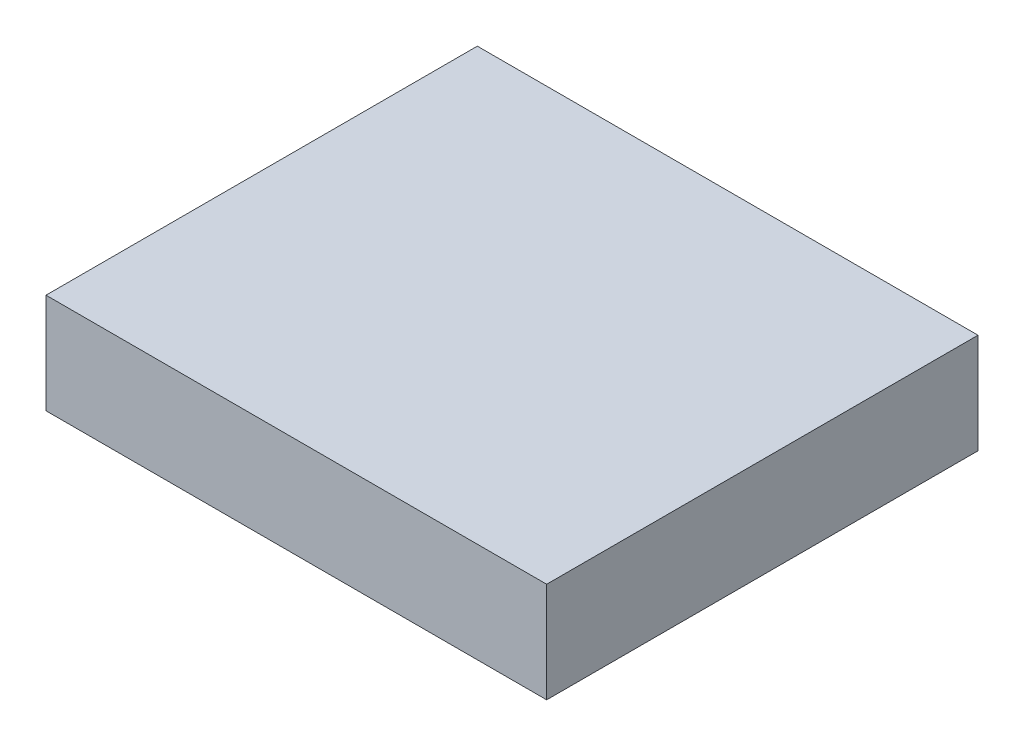
ISO-10303-21;
HEADER;
FILE_DESCRIPTION(('STEP AP214'),'2;1');
FILE_NAME('part.step','',(''),(''),'','','');
FILE_SCHEMA(('AUTOMOTIVE_DESIGN { 1 0 10303 214 1 1 1 1 }'));
ENDSEC;
DATA;
#1=APPLICATION_CONTEXT('core data for automotive mechanical design processes');
#2=APPLICATION_PROTOCOL_DEFINITION('international standard','automotive_design',2000,#1);
#3=PRODUCT_CONTEXT('',#1,'mechanical');
#4=PRODUCT('Part','Part','',(#3));
#5=PRODUCT_RELATED_PRODUCT_CATEGORY('part','',(#4));
#6=PRODUCT_DEFINITION_FORMATION('','',#4);
#7=PRODUCT_DEFINITION_CONTEXT('part definition',#1,'design');
#8=PRODUCT_DEFINITION('design','',#6,#7);
#9=PRODUCT_DEFINITION_SHAPE('','',#8);
#10=(LENGTH_UNIT() NAMED_UNIT(*) SI_UNIT(.MILLI.,.METRE.));
#11=(NAMED_UNIT(*) PLANE_ANGLE_UNIT() SI_UNIT($,.RADIAN.));
#12=(NAMED_UNIT(*) SI_UNIT($,.STERADIAN.) SOLID_ANGLE_UNIT());
#13=UNCERTAINTY_MEASURE_WITH_UNIT(LENGTH_MEASURE(1.E-05),#10,'distance_accuracy_value','');
#14=(GEOMETRIC_REPRESENTATION_CONTEXT(3) GLOBAL_UNCERTAINTY_ASSIGNED_CONTEXT((#13)) GLOBAL_UNIT_ASSIGNED_CONTEXT((#10,
#11,#12)) REPRESENTATION_CONTEXT('',''));
#15=CARTESIAN_POINT('',(0.,0.,0.));
#16=DIRECTION('',(0.,0.,1.));
#17=DIRECTION('',(1.,0.,0.));
#18=AXIS2_PLACEMENT_3D('',#15,#16,#17);
#19=CARTESIAN_POINT('',(0.,13.,0.));
#20=DIRECTION('',(1.,0.,0.));
#21=DIRECTION('',(0.,0.,-1.));
#22=AXIS2_PLACEMENT_3D('',#19,#20,#21);
#23=PLANE('',#22);
#24=DIRECTION('',(0.,0.,1.));
#25=VECTOR('',#24,1.);
#26=CARTESIAN_POINT('',(0.,0.,0.));
#27=LINE('',#26,#25);
#28=CARTESIAN_POINT('',(0.,0.,-56.));
#29=VERTEX_POINT('',#28);
#30=CARTESIAN_POINT('',(0.,0.,0.));
#31=VERTEX_POINT('',#30);
#32=EDGE_CURVE('E95',#29,#31,#27,.T.);
#33=ORIENTED_EDGE('',*,*,#32,.T.);
#34=DIRECTION('',(0.,-1.,0.));
#35=VECTOR('',#34,1.);
#36=CARTESIAN_POINT('',(0.,13.,0.));
#37=LINE('',#36,#35);
#38=CARTESIAN_POINT('',(0.,13.,0.));
#39=VERTEX_POINT('',#38);
#40=EDGE_CURVE('E11',#39,#31,#37,.T.);
#41=ORIENTED_EDGE('',*,*,#40,.F.);
#42=DIRECTION('',(0.,0.,1.));
#43=VECTOR('',#42,1.);
#44=CARTESIAN_POINT('',(0.,13.,0.));
#45=LINE('',#44,#43);
#46=CARTESIAN_POINT('',(0.,13.,-56.));
#47=VERTEX_POINT('',#46);
#48=EDGE_CURVE('E83',#47,#39,#45,.T.);
#49=ORIENTED_EDGE('',*,*,#48,.F.);
#50=DIRECTION('',(0.,-1.,0.));
#51=VECTOR('',#50,1.);
#52=CARTESIAN_POINT('',(0.,13.,-56.));
#53=LINE('',#52,#51);
#54=EDGE_CURVE('E91',#47,#29,#53,.T.);
#55=ORIENTED_EDGE('',*,*,#54,.T.);
#56=EDGE_LOOP('',(#33,#41,#49,#55));
#57=FACE_BOUND('',#56,.T.);
#58=ADVANCED_FACE('F32',(#57),#23,.F.);
#59=CARTESIAN_POINT('',(0.,13.,0.));
#60=DIRECTION('',(0.,0.,-1.));
#61=DIRECTION('',(-1.,0.,0.));
#62=AXIS2_PLACEMENT_3D('',#59,#60,#61);
#63=PLANE('',#62);
#64=DIRECTION('',(1.,0.,0.));
#65=VECTOR('',#64,1.);
#66=CARTESIAN_POINT('',(0.,0.,0.));
#67=LINE('',#66,#65);
#68=CARTESIAN_POINT('',(65.,0.,0.));
#69=VERTEX_POINT('',#68);
#70=EDGE_CURVE('E87',#31,#69,#67,.T.);
#71=ORIENTED_EDGE('',*,*,#70,.T.);
#72=DIRECTION('',(0.,-1.,0.));
#73=VECTOR('',#72,1.);
#74=CARTESIAN_POINT('',(65.,13.,0.));
#75=LINE('',#74,#73);
#76=CARTESIAN_POINT('',(65.,13.,0.));
#77=VERTEX_POINT('',#76);
#78=EDGE_CURVE('E40',#77,#69,#75,.T.);
#79=ORIENTED_EDGE('',*,*,#78,.F.);
#80=DIRECTION('',(1.,0.,0.));
#81=VECTOR('',#80,1.);
#82=CARTESIAN_POINT('',(0.,13.,0.));
#83=LINE('',#82,#81);
#84=EDGE_CURVE('E78',#39,#77,#83,.T.);
#85=ORIENTED_EDGE('',*,*,#84,.F.);
#86=ORIENTED_EDGE('',*,*,#40,.T.);
#87=EDGE_LOOP('',(#71,#79,#85,#86));
#88=FACE_BOUND('',#87,.T.);
#89=ADVANCED_FACE('F86',(#88),#63,.F.);
#90=CARTESIAN_POINT('',(65.,13.,0.));
#91=DIRECTION('',(-1.,0.,0.));
#92=DIRECTION('',(0.,0.,1.));
#93=AXIS2_PLACEMENT_3D('',#90,#91,#92);
#94=PLANE('',#93);
#95=DIRECTION('',(0.,0.,-1.));
#96=VECTOR('',#95,1.);
#97=CARTESIAN_POINT('',(65.,0.,0.));
#98=LINE('',#97,#96);
#99=CARTESIAN_POINT('',(65.,0.,-56.));
#100=VERTEX_POINT('',#99);
#101=EDGE_CURVE('E65',#69,#100,#98,.T.);
#102=ORIENTED_EDGE('',*,*,#101,.T.);
#103=DIRECTION('',(0.,-1.,0.));
#104=VECTOR('',#103,1.);
#105=CARTESIAN_POINT('',(65.,13.,-56.));
#106=LINE('',#105,#104);
#107=CARTESIAN_POINT('',(65.,13.,-56.));
#108=VERTEX_POINT('',#107);
#109=EDGE_CURVE('E88',#108,#100,#106,.T.);
#110=ORIENTED_EDGE('',*,*,#109,.F.);
#111=DIRECTION('',(0.,0.,-1.));
#112=VECTOR('',#111,1.);
#113=CARTESIAN_POINT('',(65.,13.,0.));
#114=LINE('',#113,#112);
#115=EDGE_CURVE('E81',#77,#108,#114,.T.);
#116=ORIENTED_EDGE('',*,*,#115,.F.);
#117=ORIENTED_EDGE('',*,*,#78,.T.);
#118=EDGE_LOOP('',(#102,#110,#116,#117));
#119=FACE_BOUND('',#118,.T.);
#120=ADVANCED_FACE('F89',(#119),#94,.F.);
#121=CARTESIAN_POINT('',(0.,13.,-56.));
#122=DIRECTION('',(0.,0.,1.));
#123=DIRECTION('',(1.,0.,0.));
#124=AXIS2_PLACEMENT_3D('',#121,#122,#123);
#125=PLANE('',#124);
#126=DIRECTION('',(-1.,0.,0.));
#127=VECTOR('',#126,1.);
#128=CARTESIAN_POINT('',(0.,0.,-56.));
#129=LINE('',#128,#127);
#130=EDGE_CURVE('E71',#100,#29,#129,.T.);
#131=ORIENTED_EDGE('',*,*,#130,.T.);
#132=ORIENTED_EDGE('',*,*,#54,.F.);
#133=DIRECTION('',(-1.,0.,0.));
#134=VECTOR('',#133,1.);
#135=CARTESIAN_POINT('',(0.,13.,-56.));
#136=LINE('',#135,#134);
#137=EDGE_CURVE('E48',#108,#47,#136,.T.);
#138=ORIENTED_EDGE('',*,*,#137,.F.);
#139=ORIENTED_EDGE('',*,*,#109,.T.);
#140=EDGE_LOOP('',(#131,#132,#138,#139));
#141=FACE_BOUND('',#140,.T.);
#142=ADVANCED_FACE('F102',(#141),#125,.F.);
#143=CARTESIAN_POINT('',(0.,13.,0.));
#144=DIRECTION('',(0.,-1.,0.));
#145=DIRECTION('',(0.,0.,-1.));
#146=AXIS2_PLACEMENT_3D('',#143,#144,#145);
#147=PLANE('',#146);
#148=ORIENTED_EDGE('',*,*,#48,.T.);
#149=ORIENTED_EDGE('',*,*,#84,.T.);
#150=ORIENTED_EDGE('',*,*,#115,.T.);
#151=ORIENTED_EDGE('',*,*,#137,.T.);
#152=EDGE_LOOP('',(#148,#149,#150,#151));
#153=FACE_BOUND('',#152,.T.);
#154=ADVANCED_FACE('F79',(#153),#147,.F.);
#155=CARTESIAN_POINT('',(0.,0.,0.));
#156=DIRECTION('',(0.,-1.,0.));
#157=DIRECTION('',(0.,0.,-1.));
#158=AXIS2_PLACEMENT_3D('',#155,#156,#157);
#159=PLANE('',#158);
#160=ORIENTED_EDGE('',*,*,#32,.F.);
#161=ORIENTED_EDGE('',*,*,#130,.F.);
#162=ORIENTED_EDGE('',*,*,#101,.F.);
#163=ORIENTED_EDGE('',*,*,#70,.F.);
#164=EDGE_LOOP('',(#160,#161,#162,#163));
#165=FACE_BOUND('',#164,.T.);
#166=ADVANCED_FACE('F105',(#165),#159,.T.);
#167=CLOSED_SHELL('',(#58,#89,#120,#142,#154,#166));
#168=MANIFOLD_SOLID_BREP('B2',#167);
#169=ADVANCED_BREP_SHAPE_REPRESENTATION('',(#18,#168),#14);
#170=SHAPE_DEFINITION_REPRESENTATION(#9,#169);
ENDSEC;
END-ISO-10303-21;
